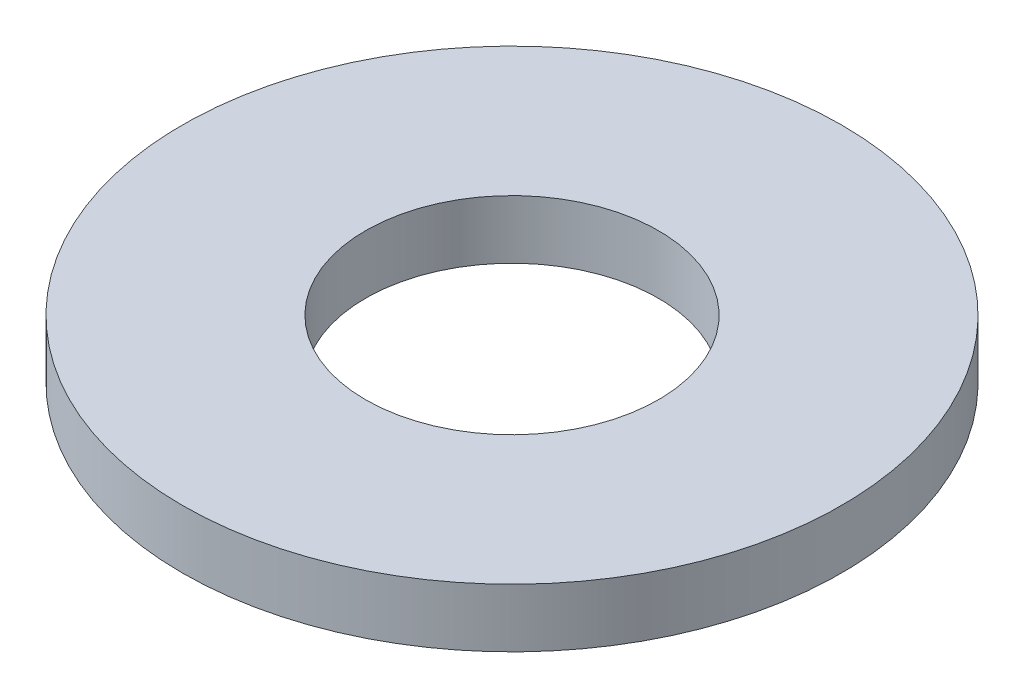
ISO-10303-21;
HEADER;
FILE_DESCRIPTION(('STEP AP214'),'2;1');
FILE_NAME('part.step','',(''),(''),'','','');
FILE_SCHEMA(('AUTOMOTIVE_DESIGN { 1 0 10303 214 1 1 1 1 }'));
ENDSEC;
DATA;
#1=APPLICATION_CONTEXT('core data for automotive mechanical design processes');
#2=APPLICATION_PROTOCOL_DEFINITION('international standard','automotive_design',2000,#1);
#3=PRODUCT_CONTEXT('',#1,'mechanical');
#4=PRODUCT('Part','Part','',(#3));
#5=PRODUCT_RELATED_PRODUCT_CATEGORY('part','',(#4));
#6=PRODUCT_DEFINITION_FORMATION('','',#4);
#7=PRODUCT_DEFINITION_CONTEXT('part definition',#1,'design');
#8=PRODUCT_DEFINITION('design','',#6,#7);
#9=PRODUCT_DEFINITION_SHAPE('','',#8);
#10=(LENGTH_UNIT() NAMED_UNIT(*) SI_UNIT(.MILLI.,.METRE.));
#11=(NAMED_UNIT(*) PLANE_ANGLE_UNIT() SI_UNIT($,.RADIAN.));
#12=(NAMED_UNIT(*) SI_UNIT($,.STERADIAN.) SOLID_ANGLE_UNIT());
#13=UNCERTAINTY_MEASURE_WITH_UNIT(LENGTH_MEASURE(1.E-05),#10,'distance_accuracy_value','');
#14=(GEOMETRIC_REPRESENTATION_CONTEXT(3) GLOBAL_UNCERTAINTY_ASSIGNED_CONTEXT((#13)) GLOBAL_UNIT_ASSIGNED_CONTEXT((#10,
#11,#12)) REPRESENTATION_CONTEXT('',''));
#15=CARTESIAN_POINT('',(0.,0.,0.));
#16=DIRECTION('',(0.,0.,1.));
#17=DIRECTION('',(1.,0.,0.));
#18=AXIS2_PLACEMENT_3D('',#15,#16,#17);
#19=CARTESIAN_POINT('',(0.,4.,0.));
#20=DIRECTION('',(0.,-1.,0.));
#21=DIRECTION('',(0.,0.,-1.));
#22=AXIS2_PLACEMENT_3D('',#19,#20,#21);
#23=CYLINDRICAL_SURFACE('',#22,22.5);
#24=CARTESIAN_POINT('',(0.,4.,0.));
#25=DIRECTION('',(0.,1.,0.));
#26=DIRECTION('',(0.,0.,1.));
#27=AXIS2_PLACEMENT_3D('',#24,#25,#26);
#28=CIRCLE('',#27,22.5);
#29=CARTESIAN_POINT('',(0.,4.,22.5));
#30=VERTEX_POINT('',#29);
#31=EDGE_CURVE('E10',#30,#30,#28,.T.);
#32=ORIENTED_EDGE('',*,*,#31,.F.);
#33=EDGE_LOOP('',(#32));
#34=FACE_BOUND('',#33,.T.);
#35=CARTESIAN_POINT('',(0.,0.,0.));
#36=DIRECTION('',(0.,1.,0.));
#37=DIRECTION('',(0.,0.,1.));
#38=AXIS2_PLACEMENT_3D('',#35,#36,#37);
#39=CIRCLE('',#38,22.5);
#40=CARTESIAN_POINT('',(0.,0.,22.5));
#41=VERTEX_POINT('',#40);
#42=EDGE_CURVE('E37',#41,#41,#39,.T.);
#43=ORIENTED_EDGE('',*,*,#42,.T.);
#44=EDGE_LOOP('',(#43));
#45=FACE_BOUND('',#44,.T.);
#46=ADVANCED_FACE('F40',(#34,#45),#23,.T.);
#47=CARTESIAN_POINT('',(0.,4.,0.));
#48=DIRECTION('',(0.,1.,0.));
#49=DIRECTION('',(0.,0.,1.));
#50=AXIS2_PLACEMENT_3D('',#47,#48,#49);
#51=PLANE('',#50);
#52=CARTESIAN_POINT('',(0.,4.,0.));
#53=DIRECTION('',(0.,1.,0.));
#54=DIRECTION('',(0.,0.,1.));
#55=AXIS2_PLACEMENT_3D('',#52,#53,#54);
#56=CIRCLE('',#55,10.);
#57=CARTESIAN_POINT('',(0.,4.,10.));
#58=VERTEX_POINT('',#57);
#59=EDGE_CURVE('E50',#58,#58,#56,.T.);
#60=ORIENTED_EDGE('',*,*,#59,.F.);
#61=EDGE_LOOP('',(#60));
#62=FACE_BOUND('',#61,.T.);
#63=ORIENTED_EDGE('',*,*,#31,.T.);
#64=EDGE_LOOP('',(#63));
#65=FACE_BOUND('',#64,.T.);
#66=ADVANCED_FACE('F59',(#62,#65),#51,.T.);
#67=CARTESIAN_POINT('',(0.,0.,0.));
#68=DIRECTION('',(0.,1.,0.));
#69=DIRECTION('',(0.,0.,1.));
#70=AXIS2_PLACEMENT_3D('',#67,#68,#69);
#71=PLANE('',#70);
#72=CARTESIAN_POINT('',(0.,0.,0.));
#73=DIRECTION('',(0.,1.,0.));
#74=DIRECTION('',(0.,0.,1.));
#75=AXIS2_PLACEMENT_3D('',#72,#73,#74);
#76=CIRCLE('',#75,10.);
#77=CARTESIAN_POINT('',(0.,0.,10.));
#78=VERTEX_POINT('',#77);
#79=EDGE_CURVE('E47',#78,#78,#76,.T.);
#80=ORIENTED_EDGE('',*,*,#79,.T.);
#81=EDGE_LOOP('',(#80));
#82=FACE_BOUND('',#81,.T.);
#83=ORIENTED_EDGE('',*,*,#42,.F.);
#84=EDGE_LOOP('',(#83));
#85=FACE_BOUND('',#84,.T.);
#86=ADVANCED_FACE('F58',(#82,#85),#71,.F.);
#87=CARTESIAN_POINT('',(0.,4.,0.));
#88=DIRECTION('',(0.,-1.,0.));
#89=DIRECTION('',(0.,0.,-1.));
#90=AXIS2_PLACEMENT_3D('',#87,#88,#89);
#91=CYLINDRICAL_SURFACE('',#90,10.);
#92=ORIENTED_EDGE('',*,*,#59,.T.);
#93=EDGE_LOOP('',(#92));
#94=FACE_BOUND('',#93,.T.);
#95=ORIENTED_EDGE('',*,*,#79,.F.);
#96=EDGE_LOOP('',(#95));
#97=FACE_BOUND('',#96,.T.);
#98=ADVANCED_FACE('F54',(#94,#97),#91,.F.);
#99=CLOSED_SHELL('',(#46,#66,#86,#98));
#100=MANIFOLD_SOLID_BREP('B2',#99);
#101=ADVANCED_BREP_SHAPE_REPRESENTATION('',(#18,#100),#14);
#102=SHAPE_DEFINITION_REPRESENTATION(#9,#101);
ENDSEC;
END-ISO-10303-21;
